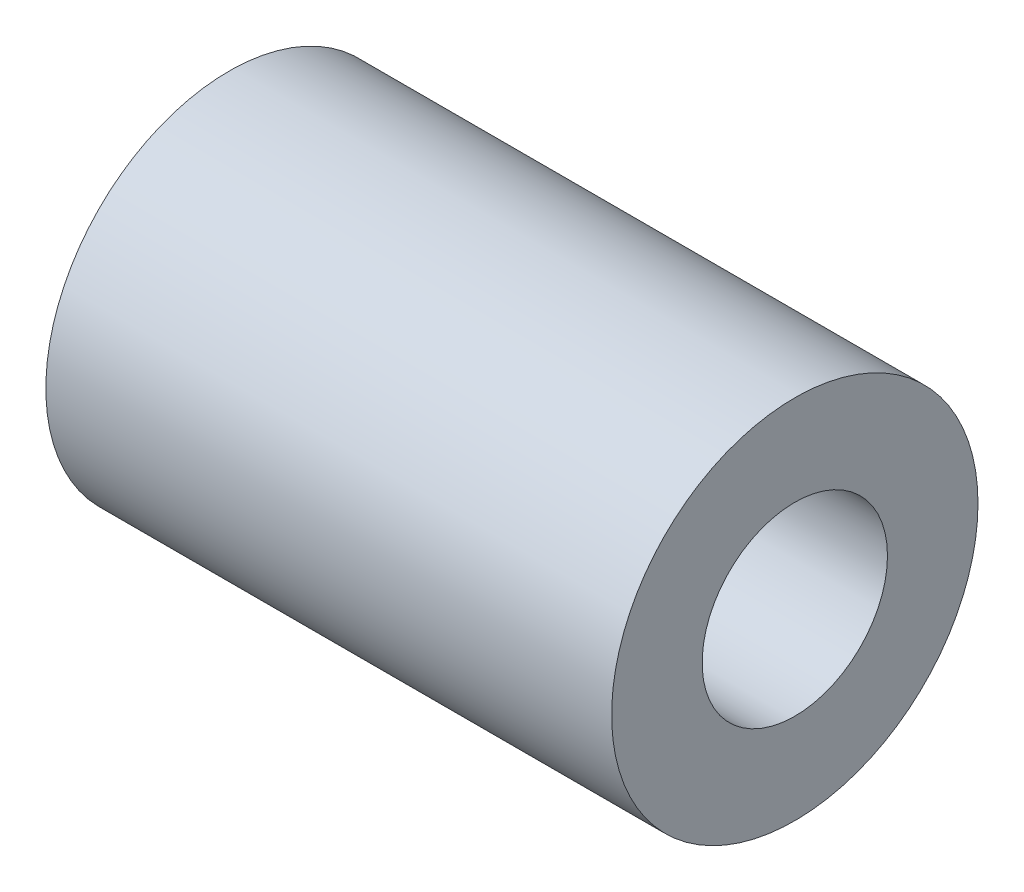
ISO-10303-21;
HEADER;
FILE_DESCRIPTION(('STEP AP214'),'2;1');
FILE_NAME('part.step','',(''),(''),'','','');
FILE_SCHEMA(('AUTOMOTIVE_DESIGN { 1 0 10303 214 1 1 1 1 }'));
ENDSEC;
DATA;
#1=APPLICATION_CONTEXT('core data for automotive mechanical design processes');
#2=APPLICATION_PROTOCOL_DEFINITION('international standard','automotive_design',2000,#1);
#3=PRODUCT_CONTEXT('',#1,'mechanical');
#4=PRODUCT('Part','Part','',(#3));
#5=PRODUCT_RELATED_PRODUCT_CATEGORY('part','',(#4));
#6=PRODUCT_DEFINITION_FORMATION('','',#4);
#7=PRODUCT_DEFINITION_CONTEXT('part definition',#1,'design');
#8=PRODUCT_DEFINITION('design','',#6,#7);
#9=PRODUCT_DEFINITION_SHAPE('','',#8);
#10=(LENGTH_UNIT() NAMED_UNIT(*) SI_UNIT(.MILLI.,.METRE.));
#11=(NAMED_UNIT(*) PLANE_ANGLE_UNIT() SI_UNIT($,.RADIAN.));
#12=(NAMED_UNIT(*) SI_UNIT($,.STERADIAN.) SOLID_ANGLE_UNIT());
#13=UNCERTAINTY_MEASURE_WITH_UNIT(LENGTH_MEASURE(1.E-05),#10,'distance_accuracy_value','');
#14=(GEOMETRIC_REPRESENTATION_CONTEXT(3) GLOBAL_UNCERTAINTY_ASSIGNED_CONTEXT((#13)) GLOBAL_UNIT_ASSIGNED_CONTEXT((#10,
#11,#12)) REPRESENTATION_CONTEXT('',''));
#15=CARTESIAN_POINT('',(0.,0.,0.));
#16=DIRECTION('',(0.,0.,1.));
#17=DIRECTION('',(1.,0.,0.));
#18=AXIS2_PLACEMENT_3D('',#15,#16,#17);
#19=CARTESIAN_POINT('',(15.875,0.,0.));
#20=DIRECTION('',(1.,0.,0.));
#21=DIRECTION('',(0.,0.,-1.));
#22=AXIS2_PLACEMENT_3D('',#19,#20,#21);
#23=PLANE('',#22);
#24=CARTESIAN_POINT('',(15.875,0.,0.));
#25=DIRECTION('',(1.,0.,0.));
#26=DIRECTION('',(0.,0.,-1.));
#27=AXIS2_PLACEMENT_3D('',#24,#25,#26);
#28=CIRCLE('',#27,5.14);
#29=CARTESIAN_POINT('',(15.875,0.,-5.14));
#30=VERTEX_POINT('',#29);
#31=EDGE_CURVE('E10',#30,#30,#28,.T.);
#32=ORIENTED_EDGE('',*,*,#31,.T.);
#33=EDGE_LOOP('',(#32));
#34=FACE_BOUND('',#33,.T.);
#35=CARTESIAN_POINT('',(15.875,0.,0.));
#36=DIRECTION('',(1.,0.,0.));
#37=DIRECTION('',(0.,0.,-1.));
#38=AXIS2_PLACEMENT_3D('',#35,#36,#37);
#39=CIRCLE('',#38,2.6);
#40=CARTESIAN_POINT('',(15.875,0.,-2.6));
#41=VERTEX_POINT('',#40);
#42=EDGE_CURVE('E43',#41,#41,#39,.T.);
#43=ORIENTED_EDGE('',*,*,#42,.F.);
#44=EDGE_LOOP('',(#43));
#45=FACE_BOUND('',#44,.T.);
#46=ADVANCED_FACE('F32',(#34,#45),#23,.T.);
#47=CARTESIAN_POINT('',(0.,0.,0.));
#48=DIRECTION('',(1.,0.,0.));
#49=DIRECTION('',(0.,0.,-1.));
#50=AXIS2_PLACEMENT_3D('',#47,#48,#49);
#51=PLANE('',#50);
#52=CARTESIAN_POINT('',(0.,0.,0.));
#53=DIRECTION('',(1.,0.,0.));
#54=DIRECTION('',(0.,0.,-1.));
#55=AXIS2_PLACEMENT_3D('',#52,#53,#54);
#56=CIRCLE('',#55,5.14);
#57=CARTESIAN_POINT('',(0.,0.,-5.14));
#58=VERTEX_POINT('',#57);
#59=EDGE_CURVE('E36',#58,#58,#56,.T.);
#60=ORIENTED_EDGE('',*,*,#59,.F.);
#61=EDGE_LOOP('',(#60));
#62=FACE_BOUND('',#61,.T.);
#63=CARTESIAN_POINT('',(0.,0.,0.));
#64=DIRECTION('',(1.,0.,0.));
#65=DIRECTION('',(0.,0.,-1.));
#66=AXIS2_PLACEMENT_3D('',#63,#64,#65);
#67=CIRCLE('',#66,2.6);
#68=CARTESIAN_POINT('',(0.,0.,-2.6));
#69=VERTEX_POINT('',#68);
#70=EDGE_CURVE('E45',#69,#69,#67,.T.);
#71=ORIENTED_EDGE('',*,*,#70,.T.);
#72=EDGE_LOOP('',(#71));
#73=FACE_BOUND('',#72,.T.);
#74=ADVANCED_FACE('F55',(#62,#73),#51,.F.);
#75=CARTESIAN_POINT('',(15.875,0.,0.));
#76=DIRECTION('',(-1.,0.,0.));
#77=DIRECTION('',(0.,0.,1.));
#78=AXIS2_PLACEMENT_3D('',#75,#76,#77);
#79=CYLINDRICAL_SURFACE('',#78,5.14);
#80=ORIENTED_EDGE('',*,*,#31,.F.);
#81=EDGE_LOOP('',(#80));
#82=FACE_BOUND('',#81,.T.);
#83=ORIENTED_EDGE('',*,*,#59,.T.);
#84=EDGE_LOOP('',(#83));
#85=FACE_BOUND('',#84,.T.);
#86=ADVANCED_FACE('F34',(#82,#85),#79,.T.);
#87=CARTESIAN_POINT('',(15.875,0.,0.));
#88=DIRECTION('',(-1.,0.,0.));
#89=DIRECTION('',(0.,0.,1.));
#90=AXIS2_PLACEMENT_3D('',#87,#88,#89);
#91=CYLINDRICAL_SURFACE('',#90,2.6);
#92=ORIENTED_EDGE('',*,*,#42,.T.);
#93=EDGE_LOOP('',(#92));
#94=FACE_BOUND('',#93,.T.);
#95=ORIENTED_EDGE('',*,*,#70,.F.);
#96=EDGE_LOOP('',(#95));
#97=FACE_BOUND('',#96,.T.);
#98=ADVANCED_FACE('F51',(#94,#97),#91,.F.);
#99=CLOSED_SHELL('',(#46,#74,#86,#98));
#100=MANIFOLD_SOLID_BREP('B2',#99);
#101=ADVANCED_BREP_SHAPE_REPRESENTATION('',(#18,#100),#14);
#102=SHAPE_DEFINITION_REPRESENTATION(#9,#101);
ENDSEC;
END-ISO-10303-21;
